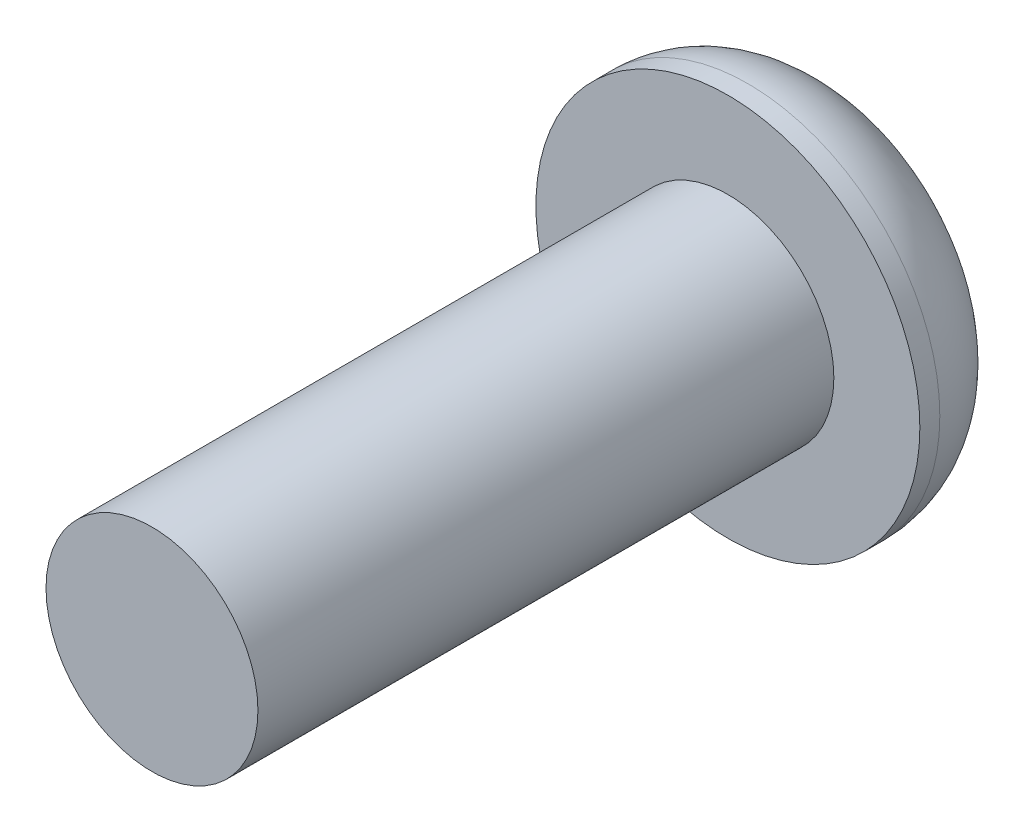
ISO-10303-21;
HEADER;
FILE_DESCRIPTION(('STEP AP214'),'2;1');
FILE_NAME('part.step','',(''),(''),'','','');
FILE_SCHEMA(('AUTOMOTIVE_DESIGN { 1 0 10303 214 1 1 1 1 }'));
ENDSEC;
DATA;
#1=APPLICATION_CONTEXT('core data for automotive mechanical design processes');
#2=APPLICATION_PROTOCOL_DEFINITION('international standard','automotive_design',2000,#1);
#3=PRODUCT_CONTEXT('',#1,'mechanical');
#4=PRODUCT('Part','Part','',(#3));
#5=PRODUCT_RELATED_PRODUCT_CATEGORY('part','',(#4));
#6=PRODUCT_DEFINITION_FORMATION('','',#4);
#7=PRODUCT_DEFINITION_CONTEXT('part definition',#1,'design');
#8=PRODUCT_DEFINITION('design','',#6,#7);
#9=PRODUCT_DEFINITION_SHAPE('','',#8);
#10=(LENGTH_UNIT() NAMED_UNIT(*) SI_UNIT(.MILLI.,.METRE.));
#11=(NAMED_UNIT(*) PLANE_ANGLE_UNIT() SI_UNIT($,.RADIAN.));
#12=(NAMED_UNIT(*) SI_UNIT($,.STERADIAN.) SOLID_ANGLE_UNIT());
#13=UNCERTAINTY_MEASURE_WITH_UNIT(LENGTH_MEASURE(1.E-05),#10,'distance_accuracy_value','');
#14=(GEOMETRIC_REPRESENTATION_CONTEXT(3) GLOBAL_UNCERTAINTY_ASSIGNED_CONTEXT((#13)) GLOBAL_UNIT_ASSIGNED_CONTEXT((#10,
#11,#12)) REPRESENTATION_CONTEXT('',''));
#15=CARTESIAN_POINT('',(0.,0.,0.));
#16=DIRECTION('',(0.,0.,1.));
#17=DIRECTION('',(1.,0.,0.));
#18=AXIS2_PLACEMENT_3D('',#15,#16,#17);
#19=CARTESIAN_POINT('',(0.,0.,1.8542));
#20=DIRECTION('',(0.,0.,1.));
#21=DIRECTION('',(1.,0.,0.));
#22=AXIS2_PLACEMENT_3D('',#19,#20,#21);
#23=PLANE('',#22);
#24=CARTESIAN_POINT('',(0.,0.,1.8542));
#25=DIRECTION('',(0.,0.,1.));
#26=DIRECTION('',(1.,0.,0.));
#27=AXIS2_PLACEMENT_3D('',#24,#25,#26);
#28=CIRCLE('',#27,3.175);
#29=CARTESIAN_POINT('',(3.175,0.,1.8542));
#30=VERTEX_POINT('',#29);
#31=EDGE_CURVE('E142',#30,#30,#28,.T.);
#32=ORIENTED_EDGE('',*,*,#31,.T.);
#33=EDGE_LOOP('',(#32));
#34=FACE_BOUND('',#33,.T.);
#35=CARTESIAN_POINT('',(0.,0.,1.8542));
#36=DIRECTION('',(0.,0.,1.));
#37=DIRECTION('',(1.,0.,0.));
#38=AXIS2_PLACEMENT_3D('',#35,#36,#37);
#39=CIRCLE('',#38,1.7526);
#40=CARTESIAN_POINT('',(1.7526,0.,1.8542));
#41=VERTEX_POINT('',#40);
#42=EDGE_CURVE('E133',#41,#41,#39,.T.);
#43=ORIENTED_EDGE('',*,*,#42,.F.);
#44=EDGE_LOOP('',(#43));
#45=FACE_BOUND('',#44,.T.);
#46=ADVANCED_FACE('F31',(#34,#45),#23,.T.);
#47=CARTESIAN_POINT('',(0.,0.,1.8542));
#48=DIRECTION('',(0.,0.,-1.));
#49=DIRECTION('',(-1.,0.,0.));
#50=AXIS2_PLACEMENT_3D('',#47,#48,#49);
#51=CYLINDRICAL_SURFACE('',#50,3.175);
#52=CARTESIAN_POINT('',(0.,0.,1.524));
#53=DIRECTION('',(0.,0.,1.));
#54=DIRECTION('',(1.,0.,0.));
#55=AXIS2_PLACEMENT_3D('',#52,#53,#54);
#56=CIRCLE('',#55,3.175);
#57=CARTESIAN_POINT('',(3.175,0.,1.524));
#58=VERTEX_POINT('',#57);
#59=EDGE_CURVE('E39',#58,#58,#56,.T.);
#60=ORIENTED_EDGE('',*,*,#59,.T.);
#61=EDGE_LOOP('',(#60));
#62=FACE_BOUND('',#61,.T.);
#63=ORIENTED_EDGE('',*,*,#31,.F.);
#64=EDGE_LOOP('',(#63));
#65=FACE_BOUND('',#64,.T.);
#66=ADVANCED_FACE('F149',(#62,#65),#51,.T.);
#67=CARTESIAN_POINT('',(0.,0.,0.));
#68=DIRECTION('',(0.,0.,1.));
#69=DIRECTION('',(1.,0.,0.));
#70=AXIS2_PLACEMENT_3D('',#67,#68,#69);
#71=PLANE('',#70);
#72=DIRECTION('',(0.999833415798117,0.0182521410653724,0.));
#73=VECTOR('',#72,1.);
#74=CARTESIAN_POINT('',(-0.590853840377281,0.981566665856041,0.));
#75=LINE('',#74,#73);
#76=CARTESIAN_POINT('',(-0.590853840377281,0.981566665856041,0.));
#77=VERTEX_POINT('',#76);
#78=CARTESIAN_POINT('',(0.554634747950682,1.00247776861834,0.));
#79=VERTEX_POINT('',#78);
#80=EDGE_CURVE('E120',#77,#79,#75,.T.);
#81=ORIENTED_EDGE('',*,*,#80,.F.);
#82=DIRECTION('',(0.484109890062989,0.875007208166425,0.));
#83=VECTOR('',#82,1.);
#84=CARTESIAN_POINT('',(-1.14548858832796,-0.020911102762301,0.));
#85=LINE('',#84,#83);
#86=CARTESIAN_POINT('',(-1.14548858832796,-0.020911102762301,0.));
#87=VERTEX_POINT('',#86);
#88=EDGE_CURVE('E46',#87,#77,#85,.T.);
#89=ORIENTED_EDGE('',*,*,#88,.F.);
#90=DIRECTION('',(-0.515723525735128,0.856755067101052,0.));
#91=VECTOR('',#90,1.);
#92=CARTESIAN_POINT('',(-0.554634747950683,-1.00247776861834,0.));
#93=LINE('',#92,#91);
#94=CARTESIAN_POINT('',(-0.554634747950683,-1.00247776861834,0.));
#95=VERTEX_POINT('',#94);
#96=EDGE_CURVE('E129',#95,#87,#93,.T.);
#97=ORIENTED_EDGE('',*,*,#96,.F.);
#98=DIRECTION('',(-0.999833415798117,-0.0182521410653724,0.));
#99=VECTOR('',#98,1.);
#100=CARTESIAN_POINT('',(0.59085384037728,-0.981566665856041,0.));
#101=LINE('',#100,#99);
#102=CARTESIAN_POINT('',(0.59085384037728,-0.981566665856041,0.));
#103=VERTEX_POINT('',#102);
#104=EDGE_CURVE('E127',#103,#95,#101,.T.);
#105=ORIENTED_EDGE('',*,*,#104,.F.);
#106=DIRECTION('',(-0.484109890062989,-0.875007208166425,0.));
#107=VECTOR('',#106,1.);
#108=CARTESIAN_POINT('',(1.14548858832796,0.0209111027623002,0.));
#109=LINE('',#108,#107);
#110=CARTESIAN_POINT('',(1.14548858832796,0.0209111027623002,0.));
#111=VERTEX_POINT('',#110);
#112=EDGE_CURVE('E94',#111,#103,#109,.T.);
#113=ORIENTED_EDGE('',*,*,#112,.F.);
#114=DIRECTION('',(0.515723525735128,-0.856755067101053,0.));
#115=VECTOR('',#114,1.);
#116=CARTESIAN_POINT('',(0.554634747950682,1.00247776861834,0.));
#117=LINE('',#116,#115);
#118=EDGE_CURVE('E123',#79,#111,#117,.T.);
#119=ORIENTED_EDGE('',*,*,#118,.F.);
#120=EDGE_LOOP('',(#81,#89,#97,#105,#113,#119));
#121=FACE_BOUND('',#120,.T.);
#122=CARTESIAN_POINT('',(0.,0.,0.));
#123=DIRECTION('',(0.,0.,1.));
#124=DIRECTION('',(1.,0.,0.));
#125=AXIS2_PLACEMENT_3D('',#122,#123,#124);
#126=CIRCLE('',#125,1.651);
#127=CARTESIAN_POINT('',(1.651,0.,0.));
#128=VERTEX_POINT('',#127);
#129=EDGE_CURVE('E11',#128,#128,#126,.F.);
#130=ORIENTED_EDGE('',*,*,#129,.T.);
#131=EDGE_LOOP('',(#130));
#132=FACE_BOUND('',#131,.T.);
#133=ADVANCED_FACE('F154',(#121,#132),#71,.F.);
#134=CARTESIAN_POINT('',(0.,0.,1.524));
#135=DIRECTION('',(0.,0.,1.));
#136=DIRECTION('',(1.,0.,0.));
#137=AXIS2_PLACEMENT_3D('',#134,#135,#136);
#138=TOROIDAL_SURFACE('',#137,1.651,1.524);
#139=ORIENTED_EDGE('',*,*,#129,.F.);
#140=EDGE_LOOP('',(#139));
#141=FACE_BOUND('',#140,.T.);
#142=ORIENTED_EDGE('',*,*,#59,.F.);
#143=EDGE_LOOP('',(#142));
#144=FACE_BOUND('',#143,.T.);
#145=ADVANCED_FACE('F33',(#141,#144),#138,.T.);
#146=CARTESIAN_POINT('',(0.,0.,11.3792));
#147=DIRECTION('',(0.,0.,-1.));
#148=DIRECTION('',(-1.,0.,0.));
#149=AXIS2_PLACEMENT_3D('',#146,#147,#148);
#150=CYLINDRICAL_SURFACE('',#149,1.7526);
#151=CARTESIAN_POINT('',(0.,0.,11.3792));
#152=DIRECTION('',(0.,0.,1.));
#153=DIRECTION('',(1.,0.,0.));
#154=AXIS2_PLACEMENT_3D('',#151,#152,#153);
#155=CIRCLE('',#154,1.7526);
#156=CARTESIAN_POINT('',(1.7526,0.,11.3792));
#157=VERTEX_POINT('',#156);
#158=EDGE_CURVE('E139',#157,#157,#155,.T.);
#159=ORIENTED_EDGE('',*,*,#158,.F.);
#160=EDGE_LOOP('',(#159));
#161=FACE_BOUND('',#160,.T.);
#162=ORIENTED_EDGE('',*,*,#42,.T.);
#163=EDGE_LOOP('',(#162));
#164=FACE_BOUND('',#163,.T.);
#165=ADVANCED_FACE('F153',(#161,#164),#150,.T.);
#166=CARTESIAN_POINT('',(0.,0.,11.3792));
#167=DIRECTION('',(0.,0.,1.));
#168=DIRECTION('',(1.,0.,0.));
#169=AXIS2_PLACEMENT_3D('',#166,#167,#168);
#170=PLANE('',#169);
#171=ORIENTED_EDGE('',*,*,#158,.T.);
#172=EDGE_LOOP('',(#171));
#173=FACE_BOUND('',#172,.T.);
#174=ADVANCED_FACE('F160',(#173),#170,.T.);
#175=CARTESIAN_POINT('',(-1.14548858832796,-0.020911102762301,1.016));
#176=DIRECTION('',(-0.875007208166425,0.484109890062989,0.));
#177=DIRECTION('',(-0.484109890062989,-0.875007208166425,0.));
#178=AXIS2_PLACEMENT_3D('',#175,#176,#177);
#179=PLANE('',#178);
#180=ORIENTED_EDGE('',*,*,#88,.T.);
#181=DIRECTION('',(0.,0.,-1.));
#182=VECTOR('',#181,1.);
#183=CARTESIAN_POINT('',(-0.590853840377281,0.981566665856041,1.016));
#184=LINE('',#183,#182);
#185=CARTESIAN_POINT('',(-0.590853840377281,0.981566665856041,1.016));
#186=VERTEX_POINT('',#185);
#187=EDGE_CURVE('E76',#186,#77,#184,.T.);
#188=ORIENTED_EDGE('',*,*,#187,.F.);
#189=DIRECTION('',(0.484109890062989,0.875007208166425,0.));
#190=VECTOR('',#189,1.);
#191=CARTESIAN_POINT('',(-1.14548858832796,-0.020911102762301,1.016));
#192=LINE('',#191,#190);
#193=CARTESIAN_POINT('',(-1.14548858832796,-0.020911102762301,1.016));
#194=VERTEX_POINT('',#193);
#195=EDGE_CURVE('E131',#194,#186,#192,.T.);
#196=ORIENTED_EDGE('',*,*,#195,.F.);
#197=DIRECTION('',(0.,0.,-1.));
#198=VECTOR('',#197,1.);
#199=CARTESIAN_POINT('',(-1.14548858832796,-0.020911102762301,1.016));
#200=LINE('',#199,#198);
#201=EDGE_CURVE('E54',#194,#87,#200,.T.);
#202=ORIENTED_EDGE('',*,*,#201,.T.);
#203=EDGE_LOOP('',(#180,#188,#196,#202));
#204=FACE_BOUND('',#203,.T.);
#205=ADVANCED_FACE('F176',(#204),#179,.F.);
#206=CARTESIAN_POINT('',(-0.554634747950683,-1.00247776861834,1.016));
#207=DIRECTION('',(-0.856755067101052,-0.515723525735128,0.));
#208=DIRECTION('',(0.515723525735128,-0.856755067101052,0.));
#209=AXIS2_PLACEMENT_3D('',#206,#207,#208);
#210=PLANE('',#209);
#211=ORIENTED_EDGE('',*,*,#96,.T.);
#212=ORIENTED_EDGE('',*,*,#201,.F.);
#213=DIRECTION('',(-0.515723525735128,0.856755067101052,0.));
#214=VECTOR('',#213,1.);
#215=CARTESIAN_POINT('',(-0.554634747950683,-1.00247776861834,1.016));
#216=LINE('',#215,#214);
#217=CARTESIAN_POINT('',(-0.554634747950683,-1.00247776861834,1.016));
#218=VERTEX_POINT('',#217);
#219=EDGE_CURVE('E106',#218,#194,#216,.T.);
#220=ORIENTED_EDGE('',*,*,#219,.F.);
#221=DIRECTION('',(0.,0.,-1.));
#222=VECTOR('',#221,1.);
#223=CARTESIAN_POINT('',(-0.554634747950683,-1.00247776861834,1.016));
#224=LINE('',#223,#222);
#225=EDGE_CURVE('E98',#218,#95,#224,.T.);
#226=ORIENTED_EDGE('',*,*,#225,.T.);
#227=EDGE_LOOP('',(#211,#212,#220,#226));
#228=FACE_BOUND('',#227,.T.);
#229=ADVANCED_FACE('F180',(#228),#210,.F.);
#230=CARTESIAN_POINT('',(0.59085384037728,-0.981566665856041,1.016));
#231=DIRECTION('',(0.0182521410653724,-0.999833415798117,0.));
#232=DIRECTION('',(0.999833415798117,0.0182521410653724,0.));
#233=AXIS2_PLACEMENT_3D('',#230,#231,#232);
#234=PLANE('',#233);
#235=ORIENTED_EDGE('',*,*,#104,.T.);
#236=ORIENTED_EDGE('',*,*,#225,.F.);
#237=DIRECTION('',(-0.999833415798117,-0.0182521410653724,0.));
#238=VECTOR('',#237,1.);
#239=CARTESIAN_POINT('',(0.59085384037728,-0.981566665856041,1.016));
#240=LINE('',#239,#238);
#241=CARTESIAN_POINT('',(0.59085384037728,-0.981566665856041,1.016));
#242=VERTEX_POINT('',#241);
#243=EDGE_CURVE('E102',#242,#218,#240,.T.);
#244=ORIENTED_EDGE('',*,*,#243,.F.);
#245=DIRECTION('',(0.,0.,-1.));
#246=VECTOR('',#245,1.);
#247=CARTESIAN_POINT('',(0.59085384037728,-0.981566665856041,1.016));
#248=LINE('',#247,#246);
#249=EDGE_CURVE('E87',#242,#103,#248,.T.);
#250=ORIENTED_EDGE('',*,*,#249,.T.);
#251=EDGE_LOOP('',(#235,#236,#244,#250));
#252=FACE_BOUND('',#251,.T.);
#253=ADVANCED_FACE('F103',(#252),#234,.F.);
#254=CARTESIAN_POINT('',(1.14548858832796,0.0209111027623002,1.016));
#255=DIRECTION('',(0.875007208166425,-0.484109890062989,0.));
#256=DIRECTION('',(0.484109890062989,0.875007208166425,0.));
#257=AXIS2_PLACEMENT_3D('',#254,#255,#256);
#258=PLANE('',#257);
#259=ORIENTED_EDGE('',*,*,#112,.T.);
#260=ORIENTED_EDGE('',*,*,#249,.F.);
#261=DIRECTION('',(-0.484109890062989,-0.875007208166425,0.));
#262=VECTOR('',#261,1.);
#263=CARTESIAN_POINT('',(1.14548858832796,0.0209111027623002,1.016));
#264=LINE('',#263,#262);
#265=CARTESIAN_POINT('',(1.14548858832796,0.0209111027623002,1.016));
#266=VERTEX_POINT('',#265);
#267=EDGE_CURVE('E91',#266,#242,#264,.T.);
#268=ORIENTED_EDGE('',*,*,#267,.F.);
#269=DIRECTION('',(0.,0.,-1.));
#270=VECTOR('',#269,1.);
#271=CARTESIAN_POINT('',(1.14548858832796,0.0209111027623002,1.016));
#272=LINE('',#271,#270);
#273=EDGE_CURVE('E99',#266,#111,#272,.T.);
#274=ORIENTED_EDGE('',*,*,#273,.T.);
#275=EDGE_LOOP('',(#259,#260,#268,#274));
#276=FACE_BOUND('',#275,.T.);
#277=ADVANCED_FACE('F89',(#276),#258,.F.);
#278=CARTESIAN_POINT('',(0.554634747950682,1.00247776861834,1.016));
#279=DIRECTION('',(0.856755067101053,0.515723525735128,0.));
#280=DIRECTION('',(-0.515723525735128,0.856755067101052,0.));
#281=AXIS2_PLACEMENT_3D('',#278,#279,#280);
#282=PLANE('',#281);
#283=ORIENTED_EDGE('',*,*,#118,.T.);
#284=ORIENTED_EDGE('',*,*,#273,.F.);
#285=DIRECTION('',(0.515723525735128,-0.856755067101053,0.));
#286=VECTOR('',#285,1.);
#287=CARTESIAN_POINT('',(0.554634747950682,1.00247776861834,1.016));
#288=LINE('',#287,#286);
#289=CARTESIAN_POINT('',(0.554634747950682,1.00247776861834,1.016));
#290=VERTEX_POINT('',#289);
#291=EDGE_CURVE('E112',#290,#266,#288,.T.);
#292=ORIENTED_EDGE('',*,*,#291,.F.);
#293=DIRECTION('',(0.,0.,-1.));
#294=VECTOR('',#293,1.);
#295=CARTESIAN_POINT('',(0.554634747950682,1.00247776861834,1.016));
#296=LINE('',#295,#294);
#297=EDGE_CURVE('E136',#290,#79,#296,.T.);
#298=ORIENTED_EDGE('',*,*,#297,.T.);
#299=EDGE_LOOP('',(#283,#284,#292,#298));
#300=FACE_BOUND('',#299,.T.);
#301=ADVANCED_FACE('F184',(#300),#282,.F.);
#302=CARTESIAN_POINT('',(-0.590853840377281,0.981566665856041,1.016));
#303=DIRECTION('',(-0.0182521410653723,0.999833415798117,0.));
#304=DIRECTION('',(-0.999833415798117,-0.0182521410653724,0.));
#305=AXIS2_PLACEMENT_3D('',#302,#303,#304);
#306=PLANE('',#305);
#307=ORIENTED_EDGE('',*,*,#80,.T.);
#308=ORIENTED_EDGE('',*,*,#297,.F.);
#309=DIRECTION('',(0.999833415798117,0.0182521410653724,0.));
#310=VECTOR('',#309,1.);
#311=CARTESIAN_POINT('',(-0.590853840377281,0.981566665856041,1.016));
#312=LINE('',#311,#310);
#313=EDGE_CURVE('E114',#186,#290,#312,.T.);
#314=ORIENTED_EDGE('',*,*,#313,.F.);
#315=ORIENTED_EDGE('',*,*,#187,.T.);
#316=EDGE_LOOP('',(#307,#308,#314,#315));
#317=FACE_BOUND('',#316,.T.);
#318=ADVANCED_FACE('F181',(#317),#306,.F.);
#319=CARTESIAN_POINT('',(-0.590853840377281,0.981566665856041,1.016));
#320=DIRECTION('',(0.,0.,-1.));
#321=DIRECTION('',(-1.,0.,0.));
#322=AXIS2_PLACEMENT_3D('',#319,#320,#321);
#323=PLANE('',#322);
#324=ORIENTED_EDGE('',*,*,#195,.T.);
#325=ORIENTED_EDGE('',*,*,#313,.T.);
#326=ORIENTED_EDGE('',*,*,#291,.T.);
#327=ORIENTED_EDGE('',*,*,#267,.T.);
#328=ORIENTED_EDGE('',*,*,#243,.T.);
#329=ORIENTED_EDGE('',*,*,#219,.T.);
#330=EDGE_LOOP('',(#324,#325,#326,#327,#328,#329));
#331=FACE_BOUND('',#330,.T.);
#332=ADVANCED_FACE('F109',(#331),#323,.T.);
#333=CLOSED_SHELL('',(#46,#66,#133,#145,#165,#174,#205,#229,#253,#277,#301,#318,#332));
#334=MANIFOLD_SOLID_BREP('B2',#333);
#335=ADVANCED_BREP_SHAPE_REPRESENTATION('',(#18,#334),#14);
#336=SHAPE_DEFINITION_REPRESENTATION(#9,#335);
ENDSEC;
END-ISO-10303-21;
